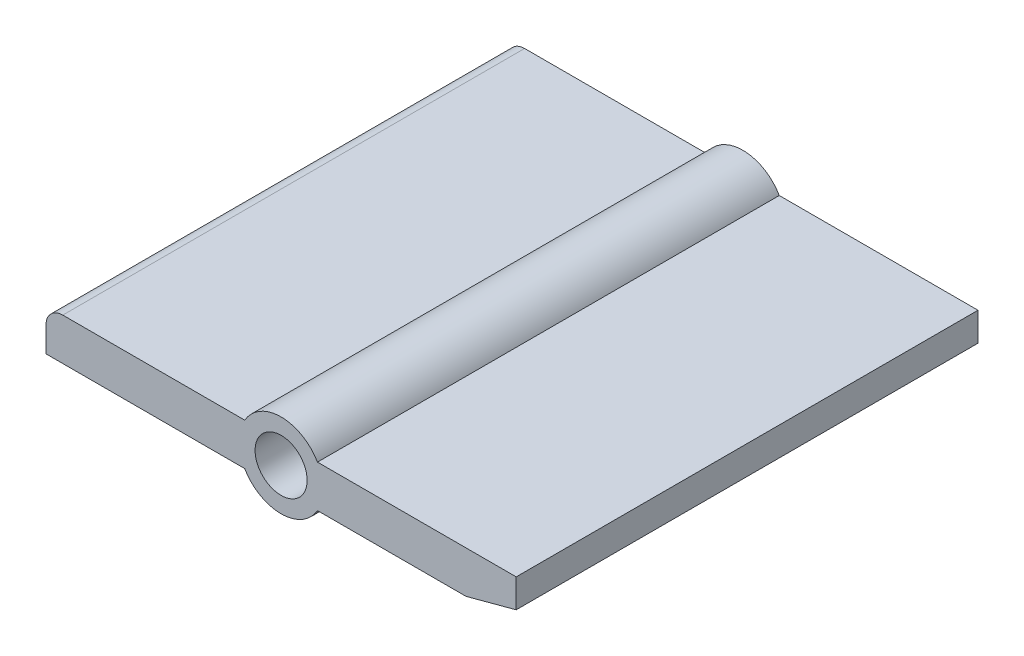
ISO-10303-21;
HEADER;
FILE_DESCRIPTION(('STEP AP214'),'2;1');
FILE_NAME('part.step','',(''),(''),'','','');
FILE_SCHEMA(('AUTOMOTIVE_DESIGN { 1 0 10303 214 1 1 1 1 }'));
ENDSEC;
DATA;
#1=APPLICATION_CONTEXT('core data for automotive mechanical design processes');
#2=APPLICATION_PROTOCOL_DEFINITION('international standard','automotive_design',2000,#1);
#3=PRODUCT_CONTEXT('',#1,'mechanical');
#4=PRODUCT('Part','Part','',(#3));
#5=PRODUCT_RELATED_PRODUCT_CATEGORY('part','',(#4));
#6=PRODUCT_DEFINITION_FORMATION('','',#4);
#7=PRODUCT_DEFINITION_CONTEXT('part definition',#1,'design');
#8=PRODUCT_DEFINITION('design','',#6,#7);
#9=PRODUCT_DEFINITION_SHAPE('','',#8);
#10=(LENGTH_UNIT() NAMED_UNIT(*) SI_UNIT(.MILLI.,.METRE.));
#11=(NAMED_UNIT(*) PLANE_ANGLE_UNIT() SI_UNIT($,.RADIAN.));
#12=(NAMED_UNIT(*) SI_UNIT($,.STERADIAN.) SOLID_ANGLE_UNIT());
#13=UNCERTAINTY_MEASURE_WITH_UNIT(LENGTH_MEASURE(1.E-05),#10,'distance_accuracy_value','');
#14=(GEOMETRIC_REPRESENTATION_CONTEXT(3) GLOBAL_UNCERTAINTY_ASSIGNED_CONTEXT((#13)) GLOBAL_UNIT_ASSIGNED_CONTEXT((#10,
#11,#12)) REPRESENTATION_CONTEXT('',''));
#15=CARTESIAN_POINT('',(0.,0.,0.));
#16=DIRECTION('',(0.,0.,1.));
#17=DIRECTION('',(1.,0.,0.));
#18=AXIS2_PLACEMENT_3D('',#15,#16,#17);
#19=CARTESIAN_POINT('',(0.,0.,27.5));
#20=DIRECTION('',(0.,0.,1.));
#21=DIRECTION('',(1.,0.,0.));
#22=AXIS2_PLACEMENT_3D('',#19,#20,#21);
#23=PLANE('',#22);
#24=DIRECTION('',(1.,0.,0.));
#25=VECTOR('',#24,1.);
#26=CARTESIAN_POINT('',(-14.,-1.25,27.5));
#27=LINE('',#26,#25);
#28=CARTESIAN_POINT('',(-14.,-1.25,27.5));
#29=VERTEX_POINT('',#28);
#30=CARTESIAN_POINT('',(-2.1650635094611,-1.25,27.5));
#31=VERTEX_POINT('',#30);
#32=EDGE_CURVE('E161',#29,#31,#27,.T.);
#33=ORIENTED_EDGE('',*,*,#32,.T.);
#34=CARTESIAN_POINT('',(0.,0.,27.5));
#35=DIRECTION('',(0.,0.,1.));
#36=DIRECTION('',(1.,0.,0.));
#37=AXIS2_PLACEMENT_3D('',#34,#35,#36);
#38=CIRCLE('',#37,2.5);
#39=CARTESIAN_POINT('',(2.1650635094611,-1.25,27.5));
#40=VERTEX_POINT('',#39);
#41=EDGE_CURVE('E99',#31,#40,#38,.T.);
#42=ORIENTED_EDGE('',*,*,#41,.T.);
#43=DIRECTION('',(1.,0.,0.));
#44=VECTOR('',#43,1.);
#45=CARTESIAN_POINT('',(2.1650635094611,-1.25,27.5));
#46=LINE('',#45,#44);
#47=CARTESIAN_POINT('',(11.0143593539449,-1.25,27.5));
#48=VERTEX_POINT('',#47);
#49=EDGE_CURVE('E182',#40,#48,#46,.T.);
#50=ORIENTED_EDGE('',*,*,#49,.T.);
#51=DIRECTION('',(0.965925826289067,0.258819045102524,0.));
#52=VECTOR('',#51,1.);
#53=CARTESIAN_POINT('',(14.,-0.45,27.5));
#54=LINE('',#53,#52);
#55=CARTESIAN_POINT('',(14.,-0.45,27.5));
#56=VERTEX_POINT('',#55);
#57=EDGE_CURVE('E201',#48,#56,#54,.T.);
#58=ORIENTED_EDGE('',*,*,#57,.T.);
#59=DIRECTION('',(0.,1.,0.));
#60=VECTOR('',#59,1.);
#61=CARTESIAN_POINT('',(14.,1.25,27.5));
#62=LINE('',#61,#60);
#63=CARTESIAN_POINT('',(14.,1.25,27.5));
#64=VERTEX_POINT('',#63);
#65=EDGE_CURVE('E198',#56,#64,#62,.T.);
#66=ORIENTED_EDGE('',*,*,#65,.T.);
#67=DIRECTION('',(-1.,0.,0.));
#68=VECTOR('',#67,1.);
#69=CARTESIAN_POINT('',(2.1650635094611,1.25,27.5));
#70=LINE('',#69,#68);
#71=CARTESIAN_POINT('',(2.1650635094611,1.25,27.5));
#72=VERTEX_POINT('',#71);
#73=EDGE_CURVE('E200',#64,#72,#70,.T.);
#74=ORIENTED_EDGE('',*,*,#73,.T.);
#75=CARTESIAN_POINT('',(0.,0.,27.5));
#76=DIRECTION('',(0.,0.,1.));
#77=DIRECTION('',(1.,0.,0.));
#78=AXIS2_PLACEMENT_3D('',#75,#76,#77);
#79=CIRCLE('',#78,2.5);
#80=CARTESIAN_POINT('',(-2.1650635094611,1.25,27.5));
#81=VERTEX_POINT('',#80);
#82=EDGE_CURVE('E124',#72,#81,#79,.T.);
#83=ORIENTED_EDGE('',*,*,#82,.T.);
#84=DIRECTION('',(-1.,0.,0.));
#85=VECTOR('',#84,1.);
#86=CARTESIAN_POINT('',(-13.,1.25,27.5));
#87=LINE('',#86,#85);
#88=CARTESIAN_POINT('',(-13.,1.25,27.5));
#89=VERTEX_POINT('',#88);
#90=EDGE_CURVE('E118',#81,#89,#87,.T.);
#91=ORIENTED_EDGE('',*,*,#90,.T.);
#92=CARTESIAN_POINT('',(-13.,0.25,27.5));
#93=DIRECTION('',(0.,0.,1.));
#94=DIRECTION('',(-1.,0.,0.));
#95=AXIS2_PLACEMENT_3D('',#92,#93,#94);
#96=CIRCLE('',#95,1.);
#97=CARTESIAN_POINT('',(-14.,0.249999999999993,27.5));
#98=VERTEX_POINT('',#97);
#99=EDGE_CURVE('E122',#89,#98,#96,.T.);
#100=ORIENTED_EDGE('',*,*,#99,.T.);
#101=DIRECTION('',(0.,-1.,0.));
#102=VECTOR('',#101,1.);
#103=CARTESIAN_POINT('',(-14.,0.249999999999993,27.5));
#104=LINE('',#103,#102);
#105=EDGE_CURVE('E50',#98,#29,#104,.T.);
#106=ORIENTED_EDGE('',*,*,#105,.T.);
#107=EDGE_LOOP('',(#33,#42,#50,#58,#66,#74,#83,#91,#100,#106));
#108=FACE_BOUND('',#107,.T.);
#109=CARTESIAN_POINT('',(0.,0.,27.5));
#110=DIRECTION('',(0.,0.,1.));
#111=DIRECTION('',(1.,0.,0.));
#112=AXIS2_PLACEMENT_3D('',#109,#110,#111);
#113=CIRCLE('',#112,1.55);
#114=CARTESIAN_POINT('',(1.55,0.,27.5));
#115=VERTEX_POINT('',#114);
#116=EDGE_CURVE('E146',#115,#115,#113,.T.);
#117=ORIENTED_EDGE('',*,*,#116,.F.);
#118=EDGE_LOOP('',(#117));
#119=FACE_BOUND('',#118,.T.);
#120=ADVANCED_FACE('F33',(#108,#119),#23,.T.);
#121=CARTESIAN_POINT('',(0.,0.,0.));
#122=DIRECTION('',(0.,0.,1.));
#123=DIRECTION('',(1.,0.,0.));
#124=AXIS2_PLACEMENT_3D('',#121,#122,#123);
#125=PLANE('',#124);
#126=DIRECTION('',(1.,0.,0.));
#127=VECTOR('',#126,1.);
#128=CARTESIAN_POINT('',(-14.,-1.25,0.));
#129=LINE('',#128,#127);
#130=CARTESIAN_POINT('',(-14.,-1.25,0.));
#131=VERTEX_POINT('',#130);
#132=CARTESIAN_POINT('',(-2.1650635094611,-1.25,0.));
#133=VERTEX_POINT('',#132);
#134=EDGE_CURVE('E142',#131,#133,#129,.T.);
#135=ORIENTED_EDGE('',*,*,#134,.F.);
#136=DIRECTION('',(0.,-1.,0.));
#137=VECTOR('',#136,1.);
#138=CARTESIAN_POINT('',(-14.,0.249999999999993,0.));
#139=LINE('',#138,#137);
#140=CARTESIAN_POINT('',(-14.,0.249999999999993,0.));
#141=VERTEX_POINT('',#140);
#142=EDGE_CURVE('E91',#141,#131,#139,.T.);
#143=ORIENTED_EDGE('',*,*,#142,.F.);
#144=CARTESIAN_POINT('',(-13.,0.25,0.));
#145=DIRECTION('',(0.,0.,1.));
#146=DIRECTION('',(-1.,0.,0.));
#147=AXIS2_PLACEMENT_3D('',#144,#145,#146);
#148=CIRCLE('',#147,1.);
#149=CARTESIAN_POINT('',(-13.,1.25,0.));
#150=VERTEX_POINT('',#149);
#151=EDGE_CURVE('E85',#150,#141,#148,.T.);
#152=ORIENTED_EDGE('',*,*,#151,.F.);
#153=DIRECTION('',(-1.,0.,0.));
#154=VECTOR('',#153,1.);
#155=CARTESIAN_POINT('',(-13.,1.25,0.));
#156=LINE('',#155,#154);
#157=CARTESIAN_POINT('',(-2.1650635094611,1.25,0.));
#158=VERTEX_POINT('',#157);
#159=EDGE_CURVE('E132',#158,#150,#156,.T.);
#160=ORIENTED_EDGE('',*,*,#159,.F.);
#161=CARTESIAN_POINT('',(0.,0.,0.));
#162=DIRECTION('',(0.,0.,1.));
#163=DIRECTION('',(1.,0.,0.));
#164=AXIS2_PLACEMENT_3D('',#161,#162,#163);
#165=CIRCLE('',#164,2.5);
#166=CARTESIAN_POINT('',(2.1650635094611,1.25,0.));
#167=VERTEX_POINT('',#166);
#168=EDGE_CURVE('E156',#167,#158,#165,.T.);
#169=ORIENTED_EDGE('',*,*,#168,.F.);
#170=DIRECTION('',(-1.,0.,0.));
#171=VECTOR('',#170,1.);
#172=CARTESIAN_POINT('',(2.1650635094611,1.25,0.));
#173=LINE('',#172,#171);
#174=CARTESIAN_POINT('',(14.,1.25,0.));
#175=VERTEX_POINT('',#174);
#176=EDGE_CURVE('E154',#175,#167,#173,.T.);
#177=ORIENTED_EDGE('',*,*,#176,.F.);
#178=DIRECTION('',(0.,1.,0.));
#179=VECTOR('',#178,1.);
#180=CARTESIAN_POINT('',(14.,1.25,0.));
#181=LINE('',#180,#179);
#182=CARTESIAN_POINT('',(14.,-0.45,0.));
#183=VERTEX_POINT('',#182);
#184=EDGE_CURVE('E152',#183,#175,#181,.T.);
#185=ORIENTED_EDGE('',*,*,#184,.F.);
#186=DIRECTION('',(0.965925826289067,0.258819045102524,0.));
#187=VECTOR('',#186,1.);
#188=CARTESIAN_POINT('',(14.,-0.45,0.));
#189=LINE('',#188,#187);
#190=CARTESIAN_POINT('',(11.0143593539449,-1.25,0.));
#191=VERTEX_POINT('',#190);
#192=EDGE_CURVE('E150',#191,#183,#189,.T.);
#193=ORIENTED_EDGE('',*,*,#192,.F.);
#194=DIRECTION('',(1.,0.,0.));
#195=VECTOR('',#194,1.);
#196=CARTESIAN_POINT('',(2.1650635094611,-1.25,0.));
#197=LINE('',#196,#195);
#198=CARTESIAN_POINT('',(2.1650635094611,-1.25,0.));
#199=VERTEX_POINT('',#198);
#200=EDGE_CURVE('E148',#199,#191,#197,.T.);
#201=ORIENTED_EDGE('',*,*,#200,.F.);
#202=CARTESIAN_POINT('',(0.,0.,0.));
#203=DIRECTION('',(0.,0.,1.));
#204=DIRECTION('',(1.,0.,0.));
#205=AXIS2_PLACEMENT_3D('',#202,#203,#204);
#206=CIRCLE('',#205,2.5);
#207=EDGE_CURVE('E145',#133,#199,#206,.T.);
#208=ORIENTED_EDGE('',*,*,#207,.F.);
#209=EDGE_LOOP('',(#135,#143,#152,#160,#169,#177,#185,#193,#201,#208));
#210=FACE_BOUND('',#209,.T.);
#211=CARTESIAN_POINT('',(0.,0.,0.));
#212=DIRECTION('',(0.,0.,1.));
#213=DIRECTION('',(1.,0.,0.));
#214=AXIS2_PLACEMENT_3D('',#211,#212,#213);
#215=CIRCLE('',#214,1.55);
#216=CARTESIAN_POINT('',(1.55,0.,0.));
#217=VERTEX_POINT('',#216);
#218=EDGE_CURVE('E209',#217,#217,#215,.T.);
#219=ORIENTED_EDGE('',*,*,#218,.T.);
#220=EDGE_LOOP('',(#219));
#221=FACE_BOUND('',#220,.T.);
#222=ADVANCED_FACE('F186',(#210,#221),#125,.F.);
#223=CARTESIAN_POINT('',(-14.,-1.25,27.5));
#224=DIRECTION('',(0.,1.,0.));
#225=DIRECTION('',(0.,0.,1.));
#226=AXIS2_PLACEMENT_3D('',#223,#224,#225);
#227=PLANE('',#226);
#228=ORIENTED_EDGE('',*,*,#134,.T.);
#229=DIRECTION('',(0.,0.,-1.));
#230=VECTOR('',#229,1.);
#231=CARTESIAN_POINT('',(-2.1650635094611,-1.25,27.5));
#232=LINE('',#231,#230);
#233=EDGE_CURVE('E11',#31,#133,#232,.T.);
#234=ORIENTED_EDGE('',*,*,#233,.F.);
#235=ORIENTED_EDGE('',*,*,#32,.F.);
#236=DIRECTION('',(0.,0.,-1.));
#237=VECTOR('',#236,1.);
#238=CARTESIAN_POINT('',(-14.,-1.25,27.5));
#239=LINE('',#238,#237);
#240=EDGE_CURVE('E138',#29,#131,#239,.T.);
#241=ORIENTED_EDGE('',*,*,#240,.T.);
#242=EDGE_LOOP('',(#228,#234,#235,#241));
#243=FACE_BOUND('',#242,.T.);
#244=ADVANCED_FACE('F35',(#243),#227,.F.);
#245=CARTESIAN_POINT('',(0.,0.,27.5));
#246=DIRECTION('',(0.,0.,-1.));
#247=DIRECTION('',(-1.,0.,0.));
#248=AXIS2_PLACEMENT_3D('',#245,#246,#247);
#249=CYLINDRICAL_SURFACE('',#248,2.5);
#250=ORIENTED_EDGE('',*,*,#207,.T.);
#251=DIRECTION('',(0.,0.,-1.));
#252=VECTOR('',#251,1.);
#253=CARTESIAN_POINT('',(2.1650635094611,-1.25,27.5));
#254=LINE('',#253,#252);
#255=EDGE_CURVE('E42',#40,#199,#254,.T.);
#256=ORIENTED_EDGE('',*,*,#255,.F.);
#257=ORIENTED_EDGE('',*,*,#41,.F.);
#258=ORIENTED_EDGE('',*,*,#233,.T.);
#259=EDGE_LOOP('',(#250,#256,#257,#258));
#260=FACE_BOUND('',#259,.T.);
#261=ADVANCED_FACE('F245',(#260),#249,.T.);
#262=CARTESIAN_POINT('',(2.1650635094611,-1.25,27.5));
#263=DIRECTION('',(0.,1.,0.));
#264=DIRECTION('',(0.,0.,1.));
#265=AXIS2_PLACEMENT_3D('',#262,#263,#264);
#266=PLANE('',#265);
#267=ORIENTED_EDGE('',*,*,#200,.T.);
#268=DIRECTION('',(0.,0.,-1.));
#269=VECTOR('',#268,1.);
#270=CARTESIAN_POINT('',(11.0143593539449,-1.25,27.5));
#271=LINE('',#270,#269);
#272=EDGE_CURVE('E174',#48,#191,#271,.T.);
#273=ORIENTED_EDGE('',*,*,#272,.F.);
#274=ORIENTED_EDGE('',*,*,#49,.F.);
#275=ORIENTED_EDGE('',*,*,#255,.T.);
#276=EDGE_LOOP('',(#267,#273,#274,#275));
#277=FACE_BOUND('',#276,.T.);
#278=ADVANCED_FACE('F180',(#277),#266,.F.);
#279=CARTESIAN_POINT('',(14.,-0.45,27.5));
#280=DIRECTION('',(-0.258819045102524,0.965925826289067,0.));
#281=DIRECTION('',(-0.965925826289068,-0.258819045102524,0.));
#282=AXIS2_PLACEMENT_3D('',#279,#280,#281);
#283=PLANE('',#282);
#284=ORIENTED_EDGE('',*,*,#192,.T.);
#285=DIRECTION('',(0.,0.,-1.));
#286=VECTOR('',#285,1.);
#287=CARTESIAN_POINT('',(14.,-0.45,27.5));
#288=LINE('',#287,#286);
#289=EDGE_CURVE('E171',#56,#183,#288,.T.);
#290=ORIENTED_EDGE('',*,*,#289,.F.);
#291=ORIENTED_EDGE('',*,*,#57,.F.);
#292=ORIENTED_EDGE('',*,*,#272,.T.);
#293=EDGE_LOOP('',(#284,#290,#291,#292));
#294=FACE_BOUND('',#293,.T.);
#295=ADVANCED_FACE('F192',(#294),#283,.F.);
#296=CARTESIAN_POINT('',(14.,1.25,27.5));
#297=DIRECTION('',(-1.,0.,0.));
#298=DIRECTION('',(0.,0.,1.));
#299=AXIS2_PLACEMENT_3D('',#296,#297,#298);
#300=PLANE('',#299);
#301=ORIENTED_EDGE('',*,*,#184,.T.);
#302=DIRECTION('',(0.,0.,-1.));
#303=VECTOR('',#302,1.);
#304=CARTESIAN_POINT('',(14.,1.25,27.5));
#305=LINE('',#304,#303);
#306=EDGE_CURVE('E168',#64,#175,#305,.T.);
#307=ORIENTED_EDGE('',*,*,#306,.F.);
#308=ORIENTED_EDGE('',*,*,#65,.F.);
#309=ORIENTED_EDGE('',*,*,#289,.T.);
#310=EDGE_LOOP('',(#301,#307,#308,#309));
#311=FACE_BOUND('',#310,.T.);
#312=ADVANCED_FACE('F196',(#311),#300,.F.);
#313=CARTESIAN_POINT('',(2.1650635094611,1.25,27.5));
#314=DIRECTION('',(0.,-1.,0.));
#315=DIRECTION('',(0.,0.,-1.));
#316=AXIS2_PLACEMENT_3D('',#313,#314,#315);
#317=PLANE('',#316);
#318=ORIENTED_EDGE('',*,*,#176,.T.);
#319=DIRECTION('',(0.,0.,-1.));
#320=VECTOR('',#319,1.);
#321=CARTESIAN_POINT('',(2.1650635094611,1.25,27.5));
#322=LINE('',#321,#320);
#323=EDGE_CURVE('E165',#72,#167,#322,.T.);
#324=ORIENTED_EDGE('',*,*,#323,.F.);
#325=ORIENTED_EDGE('',*,*,#73,.F.);
#326=ORIENTED_EDGE('',*,*,#306,.T.);
#327=EDGE_LOOP('',(#318,#324,#325,#326));
#328=FACE_BOUND('',#327,.T.);
#329=ADVANCED_FACE('F235',(#328),#317,.F.);
#330=CARTESIAN_POINT('',(0.,0.,27.5));
#331=DIRECTION('',(0.,0.,-1.));
#332=DIRECTION('',(-1.,0.,0.));
#333=AXIS2_PLACEMENT_3D('',#330,#331,#332);
#334=CYLINDRICAL_SURFACE('',#333,2.5);
#335=ORIENTED_EDGE('',*,*,#168,.T.);
#336=DIRECTION('',(0.,0.,-1.));
#337=VECTOR('',#336,1.);
#338=CARTESIAN_POINT('',(-2.1650635094611,1.25,27.5));
#339=LINE('',#338,#337);
#340=EDGE_CURVE('E133',#81,#158,#339,.T.);
#341=ORIENTED_EDGE('',*,*,#340,.F.);
#342=ORIENTED_EDGE('',*,*,#82,.F.);
#343=ORIENTED_EDGE('',*,*,#323,.T.);
#344=EDGE_LOOP('',(#335,#341,#342,#343));
#345=FACE_BOUND('',#344,.T.);
#346=ADVANCED_FACE('F232',(#345),#334,.T.);
#347=CARTESIAN_POINT('',(-13.,1.25,27.5));
#348=DIRECTION('',(0.,-1.,0.));
#349=DIRECTION('',(0.,0.,-1.));
#350=AXIS2_PLACEMENT_3D('',#347,#348,#349);
#351=PLANE('',#350);
#352=ORIENTED_EDGE('',*,*,#159,.T.);
#353=DIRECTION('',(0.,0.,-1.));
#354=VECTOR('',#353,1.);
#355=CARTESIAN_POINT('',(-13.,1.25,27.5));
#356=LINE('',#355,#354);
#357=EDGE_CURVE('E129',#89,#150,#356,.T.);
#358=ORIENTED_EDGE('',*,*,#357,.F.);
#359=ORIENTED_EDGE('',*,*,#90,.F.);
#360=ORIENTED_EDGE('',*,*,#340,.T.);
#361=EDGE_LOOP('',(#352,#358,#359,#360));
#362=FACE_BOUND('',#361,.T.);
#363=ADVANCED_FACE('F130',(#362),#351,.F.);
#364=CARTESIAN_POINT('',(-13.,0.25,27.5));
#365=DIRECTION('',(0.,0.,-1.));
#366=DIRECTION('',(-1.,0.,0.));
#367=AXIS2_PLACEMENT_3D('',#364,#365,#366);
#368=CYLINDRICAL_SURFACE('',#367,1.);
#369=ORIENTED_EDGE('',*,*,#151,.T.);
#370=DIRECTION('',(0.,0.,-1.));
#371=VECTOR('',#370,1.);
#372=CARTESIAN_POINT('',(-14.,0.249999999999993,27.5));
#373=LINE('',#372,#371);
#374=EDGE_CURVE('E134',#98,#141,#373,.T.);
#375=ORIENTED_EDGE('',*,*,#374,.F.);
#376=ORIENTED_EDGE('',*,*,#99,.F.);
#377=ORIENTED_EDGE('',*,*,#357,.T.);
#378=EDGE_LOOP('',(#369,#375,#376,#377));
#379=FACE_BOUND('',#378,.T.);
#380=ADVANCED_FACE('F136',(#379),#368,.T.);
#381=CARTESIAN_POINT('',(-14.,0.249999999999993,27.5));
#382=DIRECTION('',(1.,0.,0.));
#383=DIRECTION('',(0.,0.,-1.));
#384=AXIS2_PLACEMENT_3D('',#381,#382,#383);
#385=PLANE('',#384);
#386=ORIENTED_EDGE('',*,*,#142,.T.);
#387=ORIENTED_EDGE('',*,*,#240,.F.);
#388=ORIENTED_EDGE('',*,*,#105,.F.);
#389=ORIENTED_EDGE('',*,*,#374,.T.);
#390=EDGE_LOOP('',(#386,#387,#388,#389));
#391=FACE_BOUND('',#390,.T.);
#392=ADVANCED_FACE('F225',(#391),#385,.F.);
#393=CARTESIAN_POINT('',(0.,0.,27.5));
#394=DIRECTION('',(0.,0.,-1.));
#395=DIRECTION('',(-1.,0.,0.));
#396=AXIS2_PLACEMENT_3D('',#393,#394,#395);
#397=CYLINDRICAL_SURFACE('',#396,1.55);
#398=ORIENTED_EDGE('',*,*,#116,.T.);
#399=EDGE_LOOP('',(#398));
#400=FACE_BOUND('',#399,.T.);
#401=ORIENTED_EDGE('',*,*,#218,.F.);
#402=EDGE_LOOP('',(#401));
#403=FACE_BOUND('',#402,.T.);
#404=ADVANCED_FACE('F215',(#400,#403),#397,.F.);
#405=CLOSED_SHELL('',(#120,#222,#244,#261,#278,#295,#312,#329,#346,#363,#380,#392,#404));
#406=MANIFOLD_SOLID_BREP('B2',#405);
#407=ADVANCED_BREP_SHAPE_REPRESENTATION('',(#18,#406),#14);
#408=SHAPE_DEFINITION_REPRESENTATION(#9,#407);
ENDSEC;
END-ISO-10303-21;
